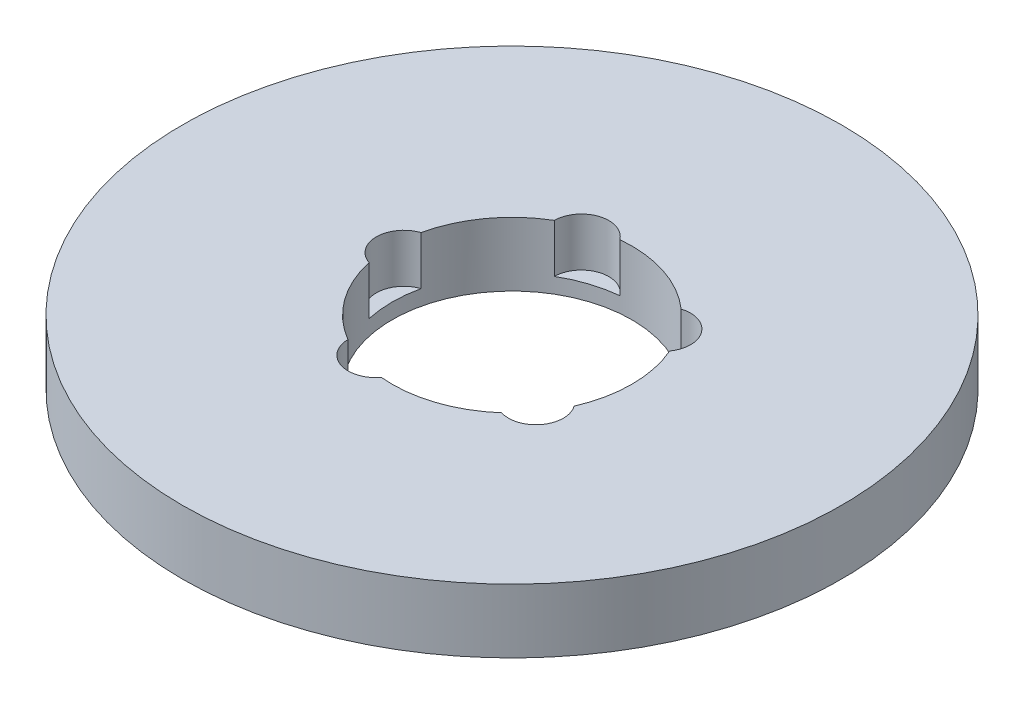
ISO-10303-21;
HEADER;
FILE_DESCRIPTION(('STEP AP214'),'2;1');
FILE_NAME('part.step','',(''),(''),'','','');
FILE_SCHEMA(('AUTOMOTIVE_DESIGN { 1 0 10303 214 1 1 1 1 }'));
ENDSEC;
DATA;
#1=APPLICATION_CONTEXT('core data for automotive mechanical design processes');
#2=APPLICATION_PROTOCOL_DEFINITION('international standard','automotive_design',2000,#1);
#3=PRODUCT_CONTEXT('',#1,'mechanical');
#4=PRODUCT('Part','Part','',(#3));
#5=PRODUCT_RELATED_PRODUCT_CATEGORY('part','',(#4));
#6=PRODUCT_DEFINITION_FORMATION('','',#4);
#7=PRODUCT_DEFINITION_CONTEXT('part definition',#1,'design');
#8=PRODUCT_DEFINITION('design','',#6,#7);
#9=PRODUCT_DEFINITION_SHAPE('','',#8);
#10=(LENGTH_UNIT() NAMED_UNIT(*) SI_UNIT(.MILLI.,.METRE.));
#11=(NAMED_UNIT(*) PLANE_ANGLE_UNIT() SI_UNIT($,.RADIAN.));
#12=(NAMED_UNIT(*) SI_UNIT($,.STERADIAN.) SOLID_ANGLE_UNIT());
#13=UNCERTAINTY_MEASURE_WITH_UNIT(LENGTH_MEASURE(1.E-05),#10,'distance_accuracy_value','');
#14=(GEOMETRIC_REPRESENTATION_CONTEXT(3) GLOBAL_UNCERTAINTY_ASSIGNED_CONTEXT((#13)) GLOBAL_UNIT_ASSIGNED_CONTEXT((#10,
#11,#12)) REPRESENTATION_CONTEXT('',''));
#15=CARTESIAN_POINT('',(0.,0.,0.));
#16=DIRECTION('',(0.,0.,1.));
#17=DIRECTION('',(1.,0.,0.));
#18=AXIS2_PLACEMENT_3D('',#15,#16,#17);
#19=CARTESIAN_POINT('',(0.,16.,0.));
#20=DIRECTION('',(0.,-1.,0.));
#21=DIRECTION('',(0.,0.,-1.));
#22=AXIS2_PLACEMENT_3D('',#19,#20,#21);
#23=CYLINDRICAL_SURFACE('',#22,82.5);
#24=CARTESIAN_POINT('',(0.,16.,0.));
#25=DIRECTION('',(0.,1.,0.));
#26=DIRECTION('',(0.,0.,1.));
#27=AXIS2_PLACEMENT_3D('',#24,#25,#26);
#28=CIRCLE('',#27,82.5);
#29=CARTESIAN_POINT('',(0.,16.,82.5));
#30=VERTEX_POINT('',#29);
#31=EDGE_CURVE('E151',#30,#30,#28,.T.);
#32=ORIENTED_EDGE('',*,*,#31,.F.);
#33=EDGE_LOOP('',(#32));
#34=FACE_BOUND('',#33,.T.);
#35=CARTESIAN_POINT('',(0.,0.,0.));
#36=DIRECTION('',(0.,1.,0.));
#37=DIRECTION('',(0.,0.,1.));
#38=AXIS2_PLACEMENT_3D('',#35,#36,#37);
#39=CIRCLE('',#38,82.5);
#40=CARTESIAN_POINT('',(0.,0.,82.5));
#41=VERTEX_POINT('',#40);
#42=EDGE_CURVE('E150',#41,#41,#39,.T.);
#43=ORIENTED_EDGE('',*,*,#42,.T.);
#44=EDGE_LOOP('',(#43));
#45=FACE_BOUND('',#44,.T.);
#46=ADVANCED_FACE('F39',(#34,#45),#23,.T.);
#47=CARTESIAN_POINT('',(0.,16.,0.));
#48=DIRECTION('',(0.,1.,0.));
#49=DIRECTION('',(0.,0.,1.));
#50=AXIS2_PLACEMENT_3D('',#47,#48,#49);
#51=PLANE('',#50);
#52=CARTESIAN_POINT('',(-8.36878028931575,16.,-25.7564573226628));
#53=DIRECTION('',(0.,1.,0.));
#54=DIRECTION('',(-0.95105651629515,0.,0.309016994374958));
#55=AXIS2_PLACEMENT_3D('',#52,#53,#54);
#56=CIRCLE('',#55,6.87244718235495);
#57=CARTESIAN_POINT('',(-2.85854282812512,16.,-29.8635016851637));
#58=VERTEX_POINT('',#57);
#59=CARTESIAN_POINT('',(-15.2407161452494,16.,-25.8402896922603));
#60=VERTEX_POINT('',#59);
#61=EDGE_CURVE('E196',#58,#60,#56,.T.);
#62=ORIENTED_EDGE('',*,*,#61,.F.);
#63=CARTESIAN_POINT('',(0.,16.,0.));
#64=DIRECTION('',(0.,1.,0.));
#65=DIRECTION('',(0.,0.,1.));
#66=AXIS2_PLACEMENT_3D('',#63,#64,#65);
#67=CIRCLE('',#66,30.);
#68=CARTESIAN_POINT('',(19.865935599452,16.,-22.4798710574243));
#69=VERTEX_POINT('',#68);
#70=EDGE_CURVE('E156',#69,#58,#67,.T.);
#71=ORIENTED_EDGE('',*,*,#70,.F.);
#72=CARTESIAN_POINT('',(21.9097512418079,16.,-15.918366055192));
#73=DIRECTION('',(0.,1.,0.));
#74=DIRECTION('',(-0.58778525229248,0.,-0.809016994374942));
#75=AXIS2_PLACEMENT_3D('',#72,#73,#74);
#76=CIRCLE('',#75,6.87244718235495);
#77=CARTESIAN_POINT('',(27.518539564027,16.,-11.9469653160576));
#78=VERTEX_POINT('',#77);
#79=EDGE_CURVE('E254',#78,#69,#76,.T.);
#80=ORIENTED_EDGE('',*,*,#79,.F.);
#81=CARTESIAN_POINT('',(27.5185395640271,16.,11.9469653160572));
#82=VERTEX_POINT('',#81);
#83=EDGE_CURVE('E153',#82,#78,#67,.T.);
#84=ORIENTED_EDGE('',*,*,#83,.F.);
#85=CARTESIAN_POINT('',(21.9097512418081,16.,15.9183660551917));
#86=DIRECTION('',(0.,1.,0.));
#87=DIRECTION('',(0.587785252292469,0.,-0.809016994374951));
#88=AXIS2_PLACEMENT_3D('',#85,#86,#87);
#89=CIRCLE('',#88,6.87244718235495);
#90=CARTESIAN_POINT('',(19.8659355994523,16.,22.479871057424));
#91=VERTEX_POINT('',#90);
#92=EDGE_CURVE('E248',#91,#82,#89,.T.);
#93=ORIENTED_EDGE('',*,*,#92,.F.);
#94=CARTESIAN_POINT('',(-2.85854282812469,16.,29.8635016851637));
#95=VERTEX_POINT('',#94);
#96=EDGE_CURVE('E140',#95,#91,#67,.T.);
#97=ORIENTED_EDGE('',*,*,#96,.F.);
#98=CARTESIAN_POINT('',(-8.36878028931539,16.,25.756457322663));
#99=DIRECTION('',(0.,1.,0.));
#100=DIRECTION('',(0.951056516295155,0.,0.309016994374945));
#101=AXIS2_PLACEMENT_3D('',#98,#99,#100);
#102=CIRCLE('',#101,6.87244718235495);
#103=CARTESIAN_POINT('',(-15.240716145249,16.,25.8402896922605));
#104=VERTEX_POINT('',#103);
#105=EDGE_CURVE('E117',#104,#95,#102,.T.);
#106=ORIENTED_EDGE('',*,*,#105,.F.);
#107=CARTESIAN_POINT('',(-29.2852161901054,16.,6.50969374846362));
#108=VERTEX_POINT('',#107);
#109=EDGE_CURVE('E133',#108,#104,#67,.T.);
#110=ORIENTED_EDGE('',*,*,#109,.F.);
#111=CARTESIAN_POINT('',(-27.0819419049852,16.,0.));
#112=DIRECTION('',(0.,1.,0.));
#113=DIRECTION('',(0.,0.,1.));
#114=AXIS2_PLACEMENT_3D('',#111,#112,#113);
#115=CIRCLE('',#114,6.87244718235495);
#116=CARTESIAN_POINT('',(-29.2852161901054,16.,-6.50969374846362));
#117=VERTEX_POINT('',#116);
#118=EDGE_CURVE('E170',#117,#108,#115,.T.);
#119=ORIENTED_EDGE('',*,*,#118,.F.);
#120=EDGE_CURVE('E149',#60,#117,#67,.T.);
#121=ORIENTED_EDGE('',*,*,#120,.F.);
#122=EDGE_LOOP('',(#62,#71,#80,#84,#93,#97,#106,#110,#119,#121));
#123=FACE_BOUND('',#122,.T.);
#124=ORIENTED_EDGE('',*,*,#31,.T.);
#125=EDGE_LOOP('',(#124));
#126=FACE_BOUND('',#125,.T.);
#127=ADVANCED_FACE('F131',(#123,#126),#51,.T.);
#128=CARTESIAN_POINT('',(0.,0.,0.));
#129=DIRECTION('',(0.,1.,0.));
#130=DIRECTION('',(0.,0.,1.));
#131=AXIS2_PLACEMENT_3D('',#128,#129,#130);
#132=PLANE('',#131);
#133=CARTESIAN_POINT('',(0.,0.,0.));
#134=DIRECTION('',(0.,1.,0.));
#135=DIRECTION('',(0.,0.,1.));
#136=AXIS2_PLACEMENT_3D('',#133,#134,#135);
#137=CIRCLE('',#136,30.);
#138=CARTESIAN_POINT('',(0.,0.,30.));
#139=VERTEX_POINT('',#138);
#140=EDGE_CURVE('E160',#139,#139,#137,.T.);
#141=ORIENTED_EDGE('',*,*,#140,.T.);
#142=EDGE_LOOP('',(#141));
#143=FACE_BOUND('',#142,.T.);
#144=ORIENTED_EDGE('',*,*,#42,.F.);
#145=EDGE_LOOP('',(#144));
#146=FACE_BOUND('',#145,.T.);
#147=ADVANCED_FACE('F212',(#143,#146),#132,.F.);
#148=CARTESIAN_POINT('',(0.,16.,0.));
#149=DIRECTION('',(0.,-1.,0.));
#150=DIRECTION('',(0.,0.,-1.));
#151=AXIS2_PLACEMENT_3D('',#148,#149,#150);
#152=CYLINDRICAL_SURFACE('',#151,30.);
#153=DIRECTION('',(0.,1.,0.));
#154=VECTOR('',#153,1.);
#155=CARTESIAN_POINT('',(-2.85854282812512,9.92193766470608,-29.8635016851637));
#156=LINE('',#155,#154);
#157=CARTESIAN_POINT('',(-2.85854282812512,3.84387532941217,-29.8635016851637));
#158=VERTEX_POINT('',#157);
#159=EDGE_CURVE('E11',#158,#58,#156,.T.);
#160=ORIENTED_EDGE('',*,*,#159,.F.);
#161=CARTESIAN_POINT('',(0.,3.84387532941217,0.));
#162=DIRECTION('',(0.,1.,0.));
#163=DIRECTION('',(0.,0.,1.));
#164=AXIS2_PLACEMENT_3D('',#161,#162,#163);
#165=CIRCLE('',#164,30.);
#166=CARTESIAN_POINT('',(-15.2407161452494,3.84387532941217,-25.8402896922603));
#167=VERTEX_POINT('',#166);
#168=EDGE_CURVE('E193',#158,#167,#165,.T.);
#169=ORIENTED_EDGE('',*,*,#168,.T.);
#170=DIRECTION('',(0.,1.,0.));
#171=VECTOR('',#170,1.);
#172=CARTESIAN_POINT('',(-15.2407161452494,9.92193766470608,-25.8402896922603));
#173=LINE('',#172,#171);
#174=EDGE_CURVE('E46',#60,#167,#173,.F.);
#175=ORIENTED_EDGE('',*,*,#174,.F.);
#176=ORIENTED_EDGE('',*,*,#120,.T.);
#177=DIRECTION('',(0.,1.,0.));
#178=VECTOR('',#177,1.);
#179=CARTESIAN_POINT('',(-29.2852161901054,9.92193766470608,-6.50969374846362));
#180=LINE('',#179,#178);
#181=CARTESIAN_POINT('',(-29.2852161901054,3.84387532941217,-6.50969374846362));
#182=VERTEX_POINT('',#181);
#183=EDGE_CURVE('E174',#182,#117,#180,.T.);
#184=ORIENTED_EDGE('',*,*,#183,.F.);
#185=CARTESIAN_POINT('',(0.,3.84387532941217,0.));
#186=DIRECTION('',(0.,1.,0.));
#187=DIRECTION('',(0.,0.,1.));
#188=AXIS2_PLACEMENT_3D('',#185,#186,#187);
#189=CIRCLE('',#188,30.);
#190=CARTESIAN_POINT('',(-29.2852161901054,3.84387532941217,6.50969374846362));
#191=VERTEX_POINT('',#190);
#192=EDGE_CURVE('E171',#182,#191,#189,.T.);
#193=ORIENTED_EDGE('',*,*,#192,.T.);
#194=DIRECTION('',(0.,1.,0.));
#195=VECTOR('',#194,1.);
#196=CARTESIAN_POINT('',(-29.2852161901054,9.92193766470608,6.50969374846362));
#197=LINE('',#196,#195);
#198=EDGE_CURVE('E148',#108,#191,#197,.F.);
#199=ORIENTED_EDGE('',*,*,#198,.F.);
#200=ORIENTED_EDGE('',*,*,#109,.T.);
#201=DIRECTION('',(0.,1.,0.));
#202=VECTOR('',#201,1.);
#203=CARTESIAN_POINT('',(-15.240716145249,9.92193766470608,25.8402896922605));
#204=LINE('',#203,#202);
#205=CARTESIAN_POINT('',(-15.240716145249,3.84387532941217,25.8402896922605));
#206=VERTEX_POINT('',#205);
#207=EDGE_CURVE('E111',#206,#104,#204,.T.);
#208=ORIENTED_EDGE('',*,*,#207,.F.);
#209=CARTESIAN_POINT('',(0.,3.84387532941217,0.));
#210=DIRECTION('',(0.,1.,0.));
#211=DIRECTION('',(0.,0.,1.));
#212=AXIS2_PLACEMENT_3D('',#209,#210,#211);
#213=CIRCLE('',#212,30.);
#214=CARTESIAN_POINT('',(-2.85854282812469,3.84387532941217,29.8635016851637));
#215=VERTEX_POINT('',#214);
#216=EDGE_CURVE('E180',#206,#215,#213,.T.);
#217=ORIENTED_EDGE('',*,*,#216,.T.);
#218=DIRECTION('',(0.,1.,0.));
#219=VECTOR('',#218,1.);
#220=CARTESIAN_POINT('',(-2.85854282812469,9.92193766470608,29.8635016851637));
#221=LINE('',#220,#219);
#222=EDGE_CURVE('E124',#95,#215,#221,.F.);
#223=ORIENTED_EDGE('',*,*,#222,.F.);
#224=ORIENTED_EDGE('',*,*,#96,.T.);
#225=DIRECTION('',(0.,1.,0.));
#226=VECTOR('',#225,1.);
#227=CARTESIAN_POINT('',(19.8659355994523,9.92193766470608,22.479871057424));
#228=LINE('',#227,#226);
#229=CARTESIAN_POINT('',(19.8659355994523,3.84387532941217,22.479871057424));
#230=VERTEX_POINT('',#229);
#231=EDGE_CURVE('E183',#230,#91,#228,.T.);
#232=ORIENTED_EDGE('',*,*,#231,.F.);
#233=CARTESIAN_POINT('',(0.,3.84387532941217,0.));
#234=DIRECTION('',(0.,1.,0.));
#235=DIRECTION('',(0.,0.,1.));
#236=AXIS2_PLACEMENT_3D('',#233,#234,#235);
#237=CIRCLE('',#236,30.);
#238=CARTESIAN_POINT('',(27.5185395640271,3.84387532941217,11.9469653160572));
#239=VERTEX_POINT('',#238);
#240=EDGE_CURVE('E123',#230,#239,#237,.T.);
#241=ORIENTED_EDGE('',*,*,#240,.T.);
#242=DIRECTION('',(0.,1.,0.));
#243=VECTOR('',#242,1.);
#244=CARTESIAN_POINT('',(27.5185395640271,9.92193766470608,11.9469653160572));
#245=LINE('',#244,#243);
#246=EDGE_CURVE('E185',#82,#239,#245,.F.);
#247=ORIENTED_EDGE('',*,*,#246,.F.);
#248=ORIENTED_EDGE('',*,*,#83,.T.);
#249=DIRECTION('',(0.,1.,0.));
#250=VECTOR('',#249,1.);
#251=CARTESIAN_POINT('',(27.518539564027,9.92193766470608,-11.9469653160576));
#252=LINE('',#251,#250);
#253=CARTESIAN_POINT('',(27.518539564027,3.84387532941217,-11.9469653160576));
#254=VERTEX_POINT('',#253);
#255=EDGE_CURVE('E195',#254,#78,#252,.T.);
#256=ORIENTED_EDGE('',*,*,#255,.F.);
#257=CARTESIAN_POINT('',(0.,3.84387532941217,0.));
#258=DIRECTION('',(0.,1.,0.));
#259=DIRECTION('',(0.,0.,1.));
#260=AXIS2_PLACEMENT_3D('',#257,#258,#259);
#261=CIRCLE('',#260,30.);
#262=CARTESIAN_POINT('',(19.865935599452,3.84387532941217,-22.4798710574243));
#263=VERTEX_POINT('',#262);
#264=EDGE_CURVE('E190',#254,#263,#261,.T.);
#265=ORIENTED_EDGE('',*,*,#264,.T.);
#266=DIRECTION('',(0.,1.,0.));
#267=VECTOR('',#266,1.);
#268=CARTESIAN_POINT('',(19.865935599452,9.92193766470608,-22.4798710574243));
#269=LINE('',#268,#267);
#270=EDGE_CURVE('E189',#69,#263,#269,.F.);
#271=ORIENTED_EDGE('',*,*,#270,.F.);
#272=ORIENTED_EDGE('',*,*,#70,.T.);
#273=EDGE_LOOP('',(#160,#169,#175,#176,#184,#193,#199,#200,#208,#217,#223,#224,#232,#241,#247,
#248,#256,#265,#271,#272));
#274=FACE_BOUND('',#273,.T.);
#275=ORIENTED_EDGE('',*,*,#140,.F.);
#276=EDGE_LOOP('',(#275));
#277=FACE_BOUND('',#276,.T.);
#278=ADVANCED_FACE('F142',(#274,#277),#152,.F.);
#279=CARTESIAN_POINT('',(-27.0819419049852,3.84387532941217,0.));
#280=DIRECTION('',(0.,1.,0.));
#281=DIRECTION('',(0.,0.,1.));
#282=AXIS2_PLACEMENT_3D('',#279,#280,#281);
#283=CYLINDRICAL_SURFACE('',#282,6.87244718235495);
#284=ORIENTED_EDGE('',*,*,#183,.T.);
#285=ORIENTED_EDGE('',*,*,#118,.T.);
#286=ORIENTED_EDGE('',*,*,#198,.T.);
#287=CARTESIAN_POINT('',(-27.0819419049852,3.84387532941217,0.));
#288=DIRECTION('',(0.,1.,0.));
#289=DIRECTION('',(0.,0.,1.));
#290=AXIS2_PLACEMENT_3D('',#287,#288,#289);
#291=CIRCLE('',#290,6.87244718235495);
#292=EDGE_CURVE('E163',#182,#191,#291,.T.);
#293=ORIENTED_EDGE('',*,*,#292,.F.);
#294=EDGE_LOOP('',(#284,#285,#286,#293));
#295=FACE_BOUND('',#294,.T.);
#296=ADVANCED_FACE('F221',(#295),#283,.F.);
#297=CARTESIAN_POINT('',(-27.0819419049852,3.84387532941217,0.));
#298=DIRECTION('',(0.,1.,0.));
#299=DIRECTION('',(0.,0.,1.));
#300=AXIS2_PLACEMENT_3D('',#297,#298,#299);
#301=PLANE('',#300);
#302=ORIENTED_EDGE('',*,*,#292,.T.);
#303=ORIENTED_EDGE('',*,*,#192,.F.);
#304=EDGE_LOOP('',(#302,#303));
#305=FACE_BOUND('',#304,.T.);
#306=ADVANCED_FACE('F227',(#305),#301,.T.);
#307=CARTESIAN_POINT('',(-8.36878028931539,3.84387532941217,25.756457322663));
#308=DIRECTION('',(0.,1.,0.));
#309=DIRECTION('',(0.,0.,1.));
#310=AXIS2_PLACEMENT_3D('',#307,#308,#309);
#311=CYLINDRICAL_SURFACE('',#310,6.87244718235495);
#312=ORIENTED_EDGE('',*,*,#207,.T.);
#313=ORIENTED_EDGE('',*,*,#105,.T.);
#314=ORIENTED_EDGE('',*,*,#222,.T.);
#315=CARTESIAN_POINT('',(-8.36878028931539,3.84387532941217,25.756457322663));
#316=DIRECTION('',(0.,1.,0.));
#317=DIRECTION('',(0.951056516295155,0.,0.309016994374945));
#318=AXIS2_PLACEMENT_3D('',#315,#316,#317);
#319=CIRCLE('',#318,6.87244718235495);
#320=EDGE_CURVE('E119',#206,#215,#319,.T.);
#321=ORIENTED_EDGE('',*,*,#320,.F.);
#322=EDGE_LOOP('',(#312,#313,#314,#321));
#323=FACE_BOUND('',#322,.T.);
#324=ADVANCED_FACE('F116',(#323),#311,.F.);
#325=CARTESIAN_POINT('',(-8.36878028931539,3.84387532941217,25.756457322663));
#326=DIRECTION('',(0.,1.,0.));
#327=DIRECTION('',(0.951056516295155,0.,0.309016994374945));
#328=AXIS2_PLACEMENT_3D('',#325,#326,#327);
#329=PLANE('',#328);
#330=ORIENTED_EDGE('',*,*,#320,.T.);
#331=ORIENTED_EDGE('',*,*,#216,.F.);
#332=EDGE_LOOP('',(#330,#331));
#333=FACE_BOUND('',#332,.T.);
#334=ADVANCED_FACE('F234',(#333),#329,.T.);
#335=CARTESIAN_POINT('',(21.9097512418081,3.84387532941217,15.9183660551917));
#336=DIRECTION('',(0.,1.,0.));
#337=DIRECTION('',(0.,0.,1.));
#338=AXIS2_PLACEMENT_3D('',#335,#336,#337);
#339=CYLINDRICAL_SURFACE('',#338,6.87244718235495);
#340=ORIENTED_EDGE('',*,*,#231,.T.);
#341=ORIENTED_EDGE('',*,*,#92,.T.);
#342=ORIENTED_EDGE('',*,*,#246,.T.);
#343=CARTESIAN_POINT('',(21.9097512418081,3.84387532941217,15.9183660551917));
#344=DIRECTION('',(0.,1.,0.));
#345=DIRECTION('',(0.587785252292469,0.,-0.809016994374951));
#346=AXIS2_PLACEMENT_3D('',#343,#344,#345);
#347=CIRCLE('',#346,6.87244718235495);
#348=EDGE_CURVE('E137',#230,#239,#347,.T.);
#349=ORIENTED_EDGE('',*,*,#348,.F.);
#350=EDGE_LOOP('',(#340,#341,#342,#349));
#351=FACE_BOUND('',#350,.T.);
#352=ADVANCED_FACE('F240',(#351),#339,.F.);
#353=CARTESIAN_POINT('',(21.9097512418081,3.84387532941217,15.9183660551917));
#354=DIRECTION('',(0.,1.,0.));
#355=DIRECTION('',(0.587785252292469,0.,-0.809016994374951));
#356=AXIS2_PLACEMENT_3D('',#353,#354,#355);
#357=PLANE('',#356);
#358=ORIENTED_EDGE('',*,*,#348,.T.);
#359=ORIENTED_EDGE('',*,*,#240,.F.);
#360=EDGE_LOOP('',(#358,#359));
#361=FACE_BOUND('',#360,.T.);
#362=ADVANCED_FACE('F245',(#361),#357,.T.);
#363=CARTESIAN_POINT('',(21.9097512418079,3.84387532941217,-15.918366055192));
#364=DIRECTION('',(0.,1.,0.));
#365=DIRECTION('',(0.,0.,1.));
#366=AXIS2_PLACEMENT_3D('',#363,#364,#365);
#367=CYLINDRICAL_SURFACE('',#366,6.87244718235495);
#368=ORIENTED_EDGE('',*,*,#255,.T.);
#369=ORIENTED_EDGE('',*,*,#79,.T.);
#370=ORIENTED_EDGE('',*,*,#270,.T.);
#371=CARTESIAN_POINT('',(21.9097512418079,3.84387532941217,-15.918366055192));
#372=DIRECTION('',(0.,1.,0.));
#373=DIRECTION('',(-0.58778525229248,0.,-0.809016994374942));
#374=AXIS2_PLACEMENT_3D('',#371,#372,#373);
#375=CIRCLE('',#374,6.87244718235495);
#376=EDGE_CURVE('E56',#254,#263,#375,.T.);
#377=ORIENTED_EDGE('',*,*,#376,.F.);
#378=EDGE_LOOP('',(#368,#369,#370,#377));
#379=FACE_BOUND('',#378,.T.);
#380=ADVANCED_FACE('F264',(#379),#367,.F.);
#381=CARTESIAN_POINT('',(21.9097512418079,3.84387532941217,-15.918366055192));
#382=DIRECTION('',(0.,1.,0.));
#383=DIRECTION('',(-0.58778525229248,0.,-0.809016994374942));
#384=AXIS2_PLACEMENT_3D('',#381,#382,#383);
#385=PLANE('',#384);
#386=ORIENTED_EDGE('',*,*,#376,.T.);
#387=ORIENTED_EDGE('',*,*,#264,.F.);
#388=EDGE_LOOP('',(#386,#387));
#389=FACE_BOUND('',#388,.T.);
#390=ADVANCED_FACE('F202',(#389),#385,.T.);
#391=CARTESIAN_POINT('',(-8.36878028931575,3.84387532941217,-25.7564573226628));
#392=DIRECTION('',(0.,1.,0.));
#393=DIRECTION('',(0.,0.,1.));
#394=AXIS2_PLACEMENT_3D('',#391,#392,#393);
#395=CYLINDRICAL_SURFACE('',#394,6.87244718235495);
#396=ORIENTED_EDGE('',*,*,#159,.T.);
#397=ORIENTED_EDGE('',*,*,#61,.T.);
#398=ORIENTED_EDGE('',*,*,#174,.T.);
#399=CARTESIAN_POINT('',(-8.36878028931575,3.84387532941217,-25.7564573226628));
#400=DIRECTION('',(0.,1.,0.));
#401=DIRECTION('',(-0.95105651629515,0.,0.309016994374958));
#402=AXIS2_PLACEMENT_3D('',#399,#400,#401);
#403=CIRCLE('',#402,6.87244718235495);
#404=EDGE_CURVE('E55',#158,#167,#403,.T.);
#405=ORIENTED_EDGE('',*,*,#404,.F.);
#406=EDGE_LOOP('',(#396,#397,#398,#405));
#407=FACE_BOUND('',#406,.T.);
#408=ADVANCED_FACE('F197',(#407),#395,.F.);
#409=CARTESIAN_POINT('',(-8.36878028931575,3.84387532941217,-25.7564573226628));
#410=DIRECTION('',(0.,1.,0.));
#411=DIRECTION('',(-0.95105651629515,0.,0.309016994374958));
#412=AXIS2_PLACEMENT_3D('',#409,#410,#411);
#413=PLANE('',#412);
#414=ORIENTED_EDGE('',*,*,#404,.T.);
#415=ORIENTED_EDGE('',*,*,#168,.F.);
#416=EDGE_LOOP('',(#414,#415));
#417=FACE_BOUND('',#416,.T.);
#418=ADVANCED_FACE('F200',(#417),#413,.T.);
#419=CLOSED_SHELL('',(#46,#127,#147,#278,#296,#306,#324,#334,#352,#362,#380,#390,#408,#418));
#420=MANIFOLD_SOLID_BREP('B2',#419);
#421=ADVANCED_BREP_SHAPE_REPRESENTATION('',(#18,#420),#14);
#422=SHAPE_DEFINITION_REPRESENTATION(#9,#421);
ENDSEC;
END-ISO-10303-21;
